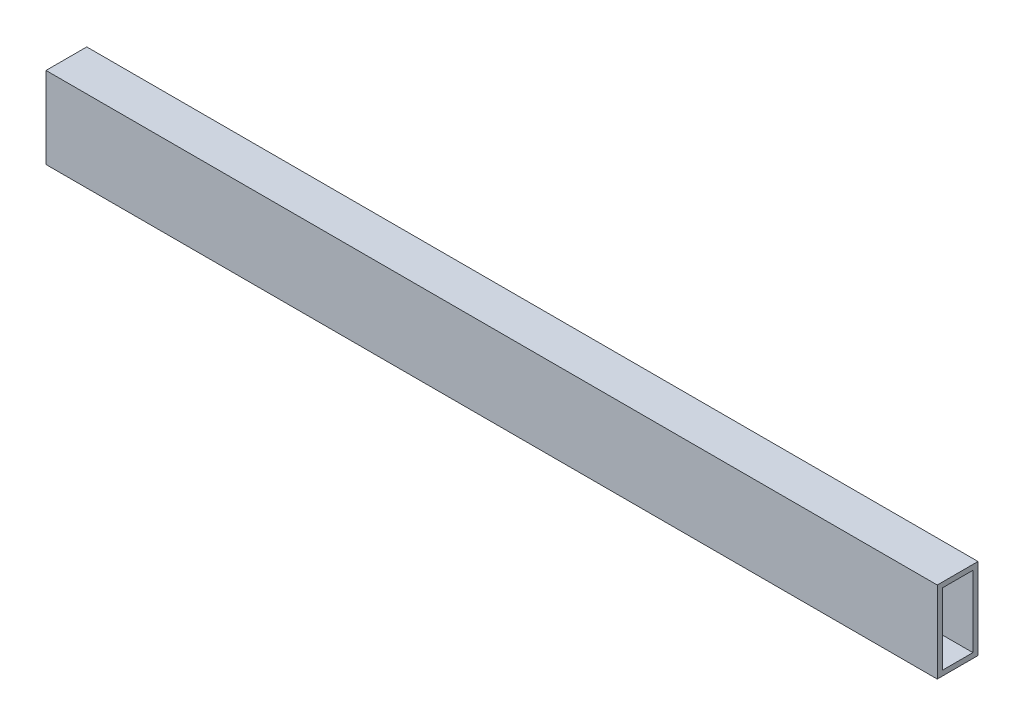
ISO-10303-21;
HEADER;
FILE_DESCRIPTION(('STEP AP214'),'2;1');
FILE_NAME('part.step','',(''),(''),'','','');
FILE_SCHEMA(('AUTOMOTIVE_DESIGN { 1 0 10303 214 1 1 1 1 }'));
ENDSEC;
DATA;
#1=APPLICATION_CONTEXT('core data for automotive mechanical design processes');
#2=APPLICATION_PROTOCOL_DEFINITION('international standard','automotive_design',2000,#1);
#3=PRODUCT_CONTEXT('',#1,'mechanical');
#4=PRODUCT('Part','Part','',(#3));
#5=PRODUCT_RELATED_PRODUCT_CATEGORY('part','',(#4));
#6=PRODUCT_DEFINITION_FORMATION('','',#4);
#7=PRODUCT_DEFINITION_CONTEXT('part definition',#1,'design');
#8=PRODUCT_DEFINITION('design','',#6,#7);
#9=PRODUCT_DEFINITION_SHAPE('','',#8);
#10=(LENGTH_UNIT() NAMED_UNIT(*) SI_UNIT(.MILLI.,.METRE.));
#11=(NAMED_UNIT(*) PLANE_ANGLE_UNIT() SI_UNIT($,.RADIAN.));
#12=(NAMED_UNIT(*) SI_UNIT($,.STERADIAN.) SOLID_ANGLE_UNIT());
#13=UNCERTAINTY_MEASURE_WITH_UNIT(LENGTH_MEASURE(1.E-05),#10,'distance_accuracy_value','');
#14=(GEOMETRIC_REPRESENTATION_CONTEXT(3) GLOBAL_UNCERTAINTY_ASSIGNED_CONTEXT((#13)) GLOBAL_UNIT_ASSIGNED_CONTEXT((#10,
#11,#12)) REPRESENTATION_CONTEXT('',''));
#15=CARTESIAN_POINT('',(0.,0.,0.));
#16=DIRECTION('',(0.,0.,1.));
#17=DIRECTION('',(1.,0.,0.));
#18=AXIS2_PLACEMENT_3D('',#15,#16,#17);
#19=CARTESIAN_POINT('',(555.625,0.,0.));
#20=DIRECTION('',(-1.,0.,0.));
#21=DIRECTION('',(0.,0.,1.));
#22=AXIS2_PLACEMENT_3D('',#19,#20,#21);
#23=PLANE('',#22);
#24=DIRECTION('',(0.,-1.,0.));
#25=VECTOR('',#24,1.);
#26=CARTESIAN_POINT('',(555.625,0.,0.));
#27=LINE('',#26,#25);
#28=CARTESIAN_POINT('',(555.625,50.8,0.));
#29=VERTEX_POINT('',#28);
#30=CARTESIAN_POINT('',(555.625,0.,0.));
#31=VERTEX_POINT('',#30);
#32=EDGE_CURVE('E134',#29,#31,#27,.T.);
#33=ORIENTED_EDGE('',*,*,#32,.T.);
#34=DIRECTION('',(0.,0.,-1.));
#35=VECTOR('',#34,1.);
#36=CARTESIAN_POINT('',(555.625,0.,0.));
#37=LINE('',#36,#35);
#38=CARTESIAN_POINT('',(555.625,0.,-25.4));
#39=VERTEX_POINT('',#38);
#40=EDGE_CURVE('E137',#31,#39,#37,.T.);
#41=ORIENTED_EDGE('',*,*,#40,.T.);
#42=DIRECTION('',(0.,1.,0.));
#43=VECTOR('',#42,1.);
#44=CARTESIAN_POINT('',(555.625,0.,-25.4));
#45=LINE('',#44,#43);
#46=CARTESIAN_POINT('',(555.625,50.8,-25.4));
#47=VERTEX_POINT('',#46);
#48=EDGE_CURVE('E140',#39,#47,#45,.T.);
#49=ORIENTED_EDGE('',*,*,#48,.T.);
#50=DIRECTION('',(0.,0.,1.));
#51=VECTOR('',#50,1.);
#52=CARTESIAN_POINT('',(555.625,50.8,0.));
#53=LINE('',#52,#51);
#54=EDGE_CURVE('E142',#47,#29,#53,.T.);
#55=ORIENTED_EDGE('',*,*,#54,.T.);
#56=EDGE_LOOP('',(#33,#41,#49,#55));
#57=FACE_BOUND('',#56,.T.);
#58=DIRECTION('',(0.,-1.,0.));
#59=VECTOR('',#58,1.);
#60=CARTESIAN_POINT('',(555.625,47.625,-3.175));
#61=LINE('',#60,#59);
#62=CARTESIAN_POINT('',(555.625,47.625,-3.175));
#63=VERTEX_POINT('',#62);
#64=CARTESIAN_POINT('',(555.625,3.175,-3.175));
#65=VERTEX_POINT('',#64);
#66=EDGE_CURVE('E98',#63,#65,#61,.T.);
#67=ORIENTED_EDGE('',*,*,#66,.F.);
#68=DIRECTION('',(0.,0.,1.));
#69=VECTOR('',#68,1.);
#70=CARTESIAN_POINT('',(555.625,47.625,-3.175));
#71=LINE('',#70,#69);
#72=CARTESIAN_POINT('',(555.625,47.625,-22.225));
#73=VERTEX_POINT('',#72);
#74=EDGE_CURVE('E120',#73,#63,#71,.T.);
#75=ORIENTED_EDGE('',*,*,#74,.F.);
#76=DIRECTION('',(0.,1.,0.));
#77=VECTOR('',#76,1.);
#78=CARTESIAN_POINT('',(555.625,47.625,-22.225));
#79=LINE('',#78,#77);
#80=CARTESIAN_POINT('',(555.625,3.175,-22.225));
#81=VERTEX_POINT('',#80);
#82=EDGE_CURVE('E118',#81,#73,#79,.T.);
#83=ORIENTED_EDGE('',*,*,#82,.F.);
#84=DIRECTION('',(0.,0.,-1.));
#85=VECTOR('',#84,1.);
#86=CARTESIAN_POINT('',(555.625,3.175,-3.175));
#87=LINE('',#86,#85);
#88=EDGE_CURVE('E106',#65,#81,#87,.T.);
#89=ORIENTED_EDGE('',*,*,#88,.F.);
#90=EDGE_LOOP('',(#67,#75,#83,#89));
#91=FACE_BOUND('',#90,.T.);
#92=ADVANCED_FACE('F33',(#57,#91),#23,.F.);
#93=CARTESIAN_POINT('',(0.,0.,0.));
#94=DIRECTION('',(-1.,0.,0.));
#95=DIRECTION('',(0.,0.,1.));
#96=AXIS2_PLACEMENT_3D('',#93,#94,#95);
#97=PLANE('',#96);
#98=DIRECTION('',(0.,-1.,0.));
#99=VECTOR('',#98,1.);
#100=CARTESIAN_POINT('',(0.,0.,0.));
#101=LINE('',#100,#99);
#102=CARTESIAN_POINT('',(0.,50.8,0.));
#103=VERTEX_POINT('',#102);
#104=CARTESIAN_POINT('',(0.,0.,0.));
#105=VERTEX_POINT('',#104);
#106=EDGE_CURVE('E114',#103,#105,#101,.T.);
#107=ORIENTED_EDGE('',*,*,#106,.F.);
#108=DIRECTION('',(0.,0.,1.));
#109=VECTOR('',#108,1.);
#110=CARTESIAN_POINT('',(0.,50.8,0.));
#111=LINE('',#110,#109);
#112=CARTESIAN_POINT('',(0.,50.8,-25.4));
#113=VERTEX_POINT('',#112);
#114=EDGE_CURVE('E138',#113,#103,#111,.T.);
#115=ORIENTED_EDGE('',*,*,#114,.F.);
#116=DIRECTION('',(0.,1.,0.));
#117=VECTOR('',#116,1.);
#118=CARTESIAN_POINT('',(0.,0.,-25.4));
#119=LINE('',#118,#117);
#120=CARTESIAN_POINT('',(0.,0.,-25.4));
#121=VERTEX_POINT('',#120);
#122=EDGE_CURVE('E149',#121,#113,#119,.T.);
#123=ORIENTED_EDGE('',*,*,#122,.F.);
#124=DIRECTION('',(0.,0.,-1.));
#125=VECTOR('',#124,1.);
#126=CARTESIAN_POINT('',(0.,0.,0.));
#127=LINE('',#126,#125);
#128=EDGE_CURVE('E147',#105,#121,#127,.T.);
#129=ORIENTED_EDGE('',*,*,#128,.F.);
#130=EDGE_LOOP('',(#107,#115,#123,#129));
#131=FACE_BOUND('',#130,.T.);
#132=DIRECTION('',(0.,0.,1.));
#133=VECTOR('',#132,1.);
#134=CARTESIAN_POINT('',(0.,47.625,-3.175));
#135=LINE('',#134,#133);
#136=CARTESIAN_POINT('',(0.,47.625,-22.225));
#137=VERTEX_POINT('',#136);
#138=CARTESIAN_POINT('',(0.,47.625,-3.175));
#139=VERTEX_POINT('',#138);
#140=EDGE_CURVE('E107',#137,#139,#135,.T.);
#141=ORIENTED_EDGE('',*,*,#140,.T.);
#142=DIRECTION('',(0.,-1.,0.));
#143=VECTOR('',#142,1.);
#144=CARTESIAN_POINT('',(0.,47.625,-3.175));
#145=LINE('',#144,#143);
#146=CARTESIAN_POINT('',(0.,3.175,-3.175));
#147=VERTEX_POINT('',#146);
#148=EDGE_CURVE('E56',#139,#147,#145,.T.);
#149=ORIENTED_EDGE('',*,*,#148,.T.);
#150=DIRECTION('',(0.,0.,-1.));
#151=VECTOR('',#150,1.);
#152=CARTESIAN_POINT('',(0.,3.175,-3.175));
#153=LINE('',#152,#151);
#154=CARTESIAN_POINT('',(0.,3.175,-22.225));
#155=VERTEX_POINT('',#154);
#156=EDGE_CURVE('E113',#147,#155,#153,.T.);
#157=ORIENTED_EDGE('',*,*,#156,.T.);
#158=DIRECTION('',(0.,1.,0.));
#159=VECTOR('',#158,1.);
#160=CARTESIAN_POINT('',(0.,47.625,-22.225));
#161=LINE('',#160,#159);
#162=EDGE_CURVE('E126',#155,#137,#161,.T.);
#163=ORIENTED_EDGE('',*,*,#162,.T.);
#164=EDGE_LOOP('',(#141,#149,#157,#163));
#165=FACE_BOUND('',#164,.T.);
#166=ADVANCED_FACE('F167',(#131,#165),#97,.T.);
#167=CARTESIAN_POINT('',(555.625,0.,0.));
#168=DIRECTION('',(0.,0.,-1.));
#169=DIRECTION('',(-1.,0.,0.));
#170=AXIS2_PLACEMENT_3D('',#167,#168,#169);
#171=PLANE('',#170);
#172=ORIENTED_EDGE('',*,*,#106,.T.);
#173=DIRECTION('',(-1.,0.,0.));
#174=VECTOR('',#173,1.);
#175=CARTESIAN_POINT('',(555.625,0.,0.));
#176=LINE('',#175,#174);
#177=EDGE_CURVE('E11',#31,#105,#176,.T.);
#178=ORIENTED_EDGE('',*,*,#177,.F.);
#179=ORIENTED_EDGE('',*,*,#32,.F.);
#180=DIRECTION('',(-1.,0.,0.));
#181=VECTOR('',#180,1.);
#182=CARTESIAN_POINT('',(555.625,50.8,0.));
#183=LINE('',#182,#181);
#184=EDGE_CURVE('E144',#29,#103,#183,.T.);
#185=ORIENTED_EDGE('',*,*,#184,.T.);
#186=EDGE_LOOP('',(#172,#178,#179,#185));
#187=FACE_BOUND('',#186,.T.);
#188=ADVANCED_FACE('F35',(#187),#171,.F.);
#189=CARTESIAN_POINT('',(555.625,0.,0.));
#190=DIRECTION('',(0.,1.,0.));
#191=DIRECTION('',(0.,0.,1.));
#192=AXIS2_PLACEMENT_3D('',#189,#190,#191);
#193=PLANE('',#192);
#194=ORIENTED_EDGE('',*,*,#128,.T.);
#195=DIRECTION('',(-1.,0.,0.));
#196=VECTOR('',#195,1.);
#197=CARTESIAN_POINT('',(555.625,0.,-25.4));
#198=LINE('',#197,#196);
#199=EDGE_CURVE('E41',#39,#121,#198,.T.);
#200=ORIENTED_EDGE('',*,*,#199,.F.);
#201=ORIENTED_EDGE('',*,*,#40,.F.);
#202=ORIENTED_EDGE('',*,*,#177,.T.);
#203=EDGE_LOOP('',(#194,#200,#201,#202));
#204=FACE_BOUND('',#203,.T.);
#205=ADVANCED_FACE('F177',(#204),#193,.F.);
#206=CARTESIAN_POINT('',(555.625,0.,-25.4));
#207=DIRECTION('',(0.,0.,1.));
#208=DIRECTION('',(1.,0.,0.));
#209=AXIS2_PLACEMENT_3D('',#206,#207,#208);
#210=PLANE('',#209);
#211=ORIENTED_EDGE('',*,*,#122,.T.);
#212=DIRECTION('',(-1.,0.,0.));
#213=VECTOR('',#212,1.);
#214=CARTESIAN_POINT('',(555.625,50.8,-25.4));
#215=LINE('',#214,#213);
#216=EDGE_CURVE('E154',#47,#113,#215,.T.);
#217=ORIENTED_EDGE('',*,*,#216,.F.);
#218=ORIENTED_EDGE('',*,*,#48,.F.);
#219=ORIENTED_EDGE('',*,*,#199,.T.);
#220=EDGE_LOOP('',(#211,#217,#218,#219));
#221=FACE_BOUND('',#220,.T.);
#222=ADVANCED_FACE('F161',(#221),#210,.F.);
#223=CARTESIAN_POINT('',(555.625,50.8,0.));
#224=DIRECTION('',(0.,-1.,0.));
#225=DIRECTION('',(0.,0.,-1.));
#226=AXIS2_PLACEMENT_3D('',#223,#224,#225);
#227=PLANE('',#226);
#228=ORIENTED_EDGE('',*,*,#114,.T.);
#229=ORIENTED_EDGE('',*,*,#184,.F.);
#230=ORIENTED_EDGE('',*,*,#54,.F.);
#231=ORIENTED_EDGE('',*,*,#216,.T.);
#232=EDGE_LOOP('',(#228,#229,#230,#231));
#233=FACE_BOUND('',#232,.T.);
#234=ADVANCED_FACE('F171',(#233),#227,.F.);
#235=CARTESIAN_POINT('',(555.625,47.625,-3.175));
#236=DIRECTION('',(0.,0.,-1.));
#237=DIRECTION('',(0.,1.,0.));
#238=AXIS2_PLACEMENT_3D('',#235,#236,#237);
#239=PLANE('',#238);
#240=ORIENTED_EDGE('',*,*,#148,.F.);
#241=DIRECTION('',(-1.,0.,0.));
#242=VECTOR('',#241,1.);
#243=CARTESIAN_POINT('',(555.625,47.625,-3.175));
#244=LINE('',#243,#242);
#245=EDGE_CURVE('E102',#63,#139,#244,.T.);
#246=ORIENTED_EDGE('',*,*,#245,.F.);
#247=ORIENTED_EDGE('',*,*,#66,.T.);
#248=DIRECTION('',(-1.,0.,0.));
#249=VECTOR('',#248,1.);
#250=CARTESIAN_POINT('',(555.625,3.175,-3.175));
#251=LINE('',#250,#249);
#252=EDGE_CURVE('E101',#65,#147,#251,.T.);
#253=ORIENTED_EDGE('',*,*,#252,.T.);
#254=EDGE_LOOP('',(#240,#246,#247,#253));
#255=FACE_BOUND('',#254,.T.);
#256=ADVANCED_FACE('F100',(#255),#239,.T.);
#257=CARTESIAN_POINT('',(555.625,3.175,-3.175));
#258=DIRECTION('',(0.,1.,0.));
#259=DIRECTION('',(0.,0.,1.));
#260=AXIS2_PLACEMENT_3D('',#257,#258,#259);
#261=PLANE('',#260);
#262=ORIENTED_EDGE('',*,*,#156,.F.);
#263=ORIENTED_EDGE('',*,*,#252,.F.);
#264=ORIENTED_EDGE('',*,*,#88,.T.);
#265=DIRECTION('',(-1.,0.,0.));
#266=VECTOR('',#265,1.);
#267=CARTESIAN_POINT('',(555.625,3.175,-22.225));
#268=LINE('',#267,#266);
#269=EDGE_CURVE('E115',#81,#155,#268,.T.);
#270=ORIENTED_EDGE('',*,*,#269,.T.);
#271=EDGE_LOOP('',(#262,#263,#264,#270));
#272=FACE_BOUND('',#271,.T.);
#273=ADVANCED_FACE('F110',(#272),#261,.T.);
#274=CARTESIAN_POINT('',(555.625,47.625,-22.225));
#275=DIRECTION('',(0.,0.,1.));
#276=DIRECTION('',(1.,0.,0.));
#277=AXIS2_PLACEMENT_3D('',#274,#275,#276);
#278=PLANE('',#277);
#279=ORIENTED_EDGE('',*,*,#162,.F.);
#280=ORIENTED_EDGE('',*,*,#269,.F.);
#281=ORIENTED_EDGE('',*,*,#82,.T.);
#282=DIRECTION('',(-1.,0.,0.));
#283=VECTOR('',#282,1.);
#284=CARTESIAN_POINT('',(555.625,47.625,-22.225));
#285=LINE('',#284,#283);
#286=EDGE_CURVE('E48',#73,#137,#285,.T.);
#287=ORIENTED_EDGE('',*,*,#286,.T.);
#288=EDGE_LOOP('',(#279,#280,#281,#287));
#289=FACE_BOUND('',#288,.T.);
#290=ADVANCED_FACE('F200',(#289),#278,.T.);
#291=CARTESIAN_POINT('',(555.625,47.625,-3.175));
#292=DIRECTION('',(0.,-1.,0.));
#293=DIRECTION('',(0.,0.,-1.));
#294=AXIS2_PLACEMENT_3D('',#291,#292,#293);
#295=PLANE('',#294);
#296=ORIENTED_EDGE('',*,*,#140,.F.);
#297=ORIENTED_EDGE('',*,*,#286,.F.);
#298=ORIENTED_EDGE('',*,*,#74,.T.);
#299=ORIENTED_EDGE('',*,*,#245,.T.);
#300=EDGE_LOOP('',(#296,#297,#298,#299));
#301=FACE_BOUND('',#300,.T.);
#302=ADVANCED_FACE('F204',(#301),#295,.T.);
#303=CLOSED_SHELL('',(#92,#166,#188,#205,#222,#234,#256,#273,#290,#302));
#304=MANIFOLD_SOLID_BREP('B2',#303);
#305=ADVANCED_BREP_SHAPE_REPRESENTATION('',(#18,#304),#14);
#306=SHAPE_DEFINITION_REPRESENTATION(#9,#305);
ENDSEC;
END-ISO-10303-21;
